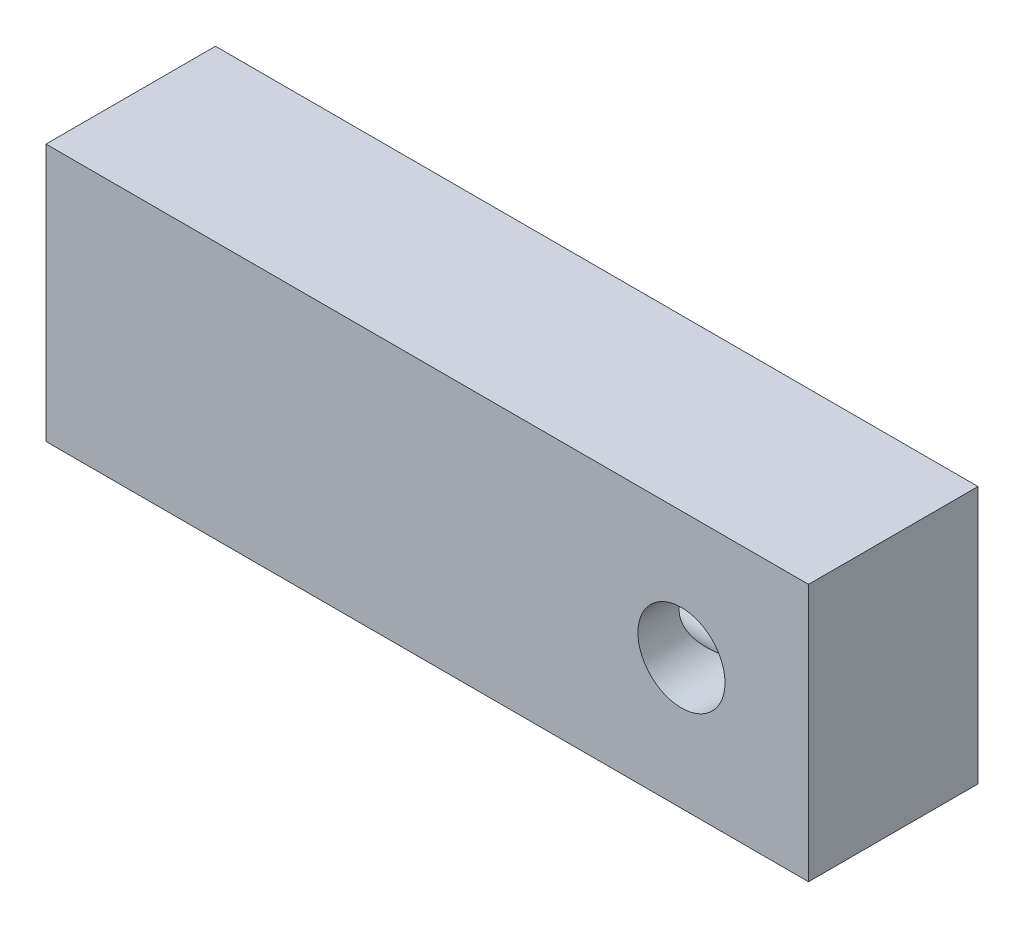
ISO-10303-21;
HEADER;
FILE_DESCRIPTION(('STEP AP214'),'2;1');
FILE_NAME('part.step','',(''),(''),'','','');
FILE_SCHEMA(('AUTOMOTIVE_DESIGN { 1 0 10303 214 1 1 1 1 }'));
ENDSEC;
DATA;
#1=APPLICATION_CONTEXT('core data for automotive mechanical design processes');
#2=APPLICATION_PROTOCOL_DEFINITION('international standard','automotive_design',2000,#1);
#3=PRODUCT_CONTEXT('',#1,'mechanical');
#4=PRODUCT('Part','Part','',(#3));
#5=PRODUCT_RELATED_PRODUCT_CATEGORY('part','',(#4));
#6=PRODUCT_DEFINITION_FORMATION('','',#4);
#7=PRODUCT_DEFINITION_CONTEXT('part definition',#1,'design');
#8=PRODUCT_DEFINITION('design','',#6,#7);
#9=PRODUCT_DEFINITION_SHAPE('','',#8);
#10=(LENGTH_UNIT() NAMED_UNIT(*) SI_UNIT(.MILLI.,.METRE.));
#11=(NAMED_UNIT(*) PLANE_ANGLE_UNIT() SI_UNIT($,.RADIAN.));
#12=(NAMED_UNIT(*) SI_UNIT($,.STERADIAN.) SOLID_ANGLE_UNIT());
#13=UNCERTAINTY_MEASURE_WITH_UNIT(LENGTH_MEASURE(1.E-05),#10,'distance_accuracy_value','');
#14=(GEOMETRIC_REPRESENTATION_CONTEXT(3) GLOBAL_UNCERTAINTY_ASSIGNED_CONTEXT((#13)) GLOBAL_UNIT_ASSIGNED_CONTEXT((#10,
#11,#12)) REPRESENTATION_CONTEXT('',''));
#15=CARTESIAN_POINT('',(0.,0.,0.));
#16=DIRECTION('',(0.,0.,1.));
#17=DIRECTION('',(1.,0.,0.));
#18=AXIS2_PLACEMENT_3D('',#15,#16,#17);
#19=CARTESIAN_POINT('',(14.2875,-4.826,6.35));
#20=DIRECTION('',(-1.,0.,0.));
#21=DIRECTION('',(0.,0.,1.));
#22=AXIS2_PLACEMENT_3D('',#19,#20,#21);
#23=PLANE('',#22);
#24=DIRECTION('',(0.,1.,0.));
#25=VECTOR('',#24,1.);
#26=CARTESIAN_POINT('',(14.2875,-4.826,0.));
#27=LINE('',#26,#25);
#28=CARTESIAN_POINT('',(14.2875,-4.826,0.));
#29=VERTEX_POINT('',#28);
#30=CARTESIAN_POINT('',(14.2875,4.826,0.));
#31=VERTEX_POINT('',#30);
#32=EDGE_CURVE('E115',#29,#31,#27,.T.);
#33=ORIENTED_EDGE('',*,*,#32,.T.);
#34=DIRECTION('',(0.,0.,-1.));
#35=VECTOR('',#34,1.);
#36=CARTESIAN_POINT('',(14.2875,4.826,6.35));
#37=LINE('',#36,#35);
#38=CARTESIAN_POINT('',(14.2875,4.826,6.35));
#39=VERTEX_POINT('',#38);
#40=EDGE_CURVE('E97',#39,#31,#37,.T.);
#41=ORIENTED_EDGE('',*,*,#40,.F.);
#42=DIRECTION('',(0.,1.,0.));
#43=VECTOR('',#42,1.);
#44=CARTESIAN_POINT('',(14.2875,-4.826,6.35));
#45=LINE('',#44,#43);
#46=CARTESIAN_POINT('',(14.2875,-4.826,6.35));
#47=VERTEX_POINT('',#46);
#48=EDGE_CURVE('E119',#47,#39,#45,.T.);
#49=ORIENTED_EDGE('',*,*,#48,.F.);
#50=DIRECTION('',(0.,0.,-1.));
#51=VECTOR('',#50,1.);
#52=CARTESIAN_POINT('',(14.2875,-4.826,6.35));
#53=LINE('',#52,#51);
#54=EDGE_CURVE('E125',#47,#29,#53,.T.);
#55=ORIENTED_EDGE('',*,*,#54,.T.);
#56=EDGE_LOOP('',(#33,#41,#49,#55));
#57=FACE_BOUND('',#56,.T.);
#58=ADVANCED_FACE('F35',(#57),#23,.F.);
#59=CARTESIAN_POINT('',(-14.2875,4.826,6.35));
#60=DIRECTION('',(0.,-1.,0.));
#61=DIRECTION('',(0.,0.,-1.));
#62=AXIS2_PLACEMENT_3D('',#59,#60,#61);
#63=PLANE('',#62);
#64=DIRECTION('',(-1.,0.,0.));
#65=VECTOR('',#64,1.);
#66=CARTESIAN_POINT('',(-14.2875,4.826,0.));
#67=LINE('',#66,#65);
#68=CARTESIAN_POINT('',(-14.2875,4.826,0.));
#69=VERTEX_POINT('',#68);
#70=EDGE_CURVE('E128',#31,#69,#67,.T.);
#71=ORIENTED_EDGE('',*,*,#70,.T.);
#72=DIRECTION('',(0.,0.,-1.));
#73=VECTOR('',#72,1.);
#74=CARTESIAN_POINT('',(-14.2875,4.826,6.35));
#75=LINE('',#74,#73);
#76=CARTESIAN_POINT('',(-14.2875,4.826,6.35));
#77=VERTEX_POINT('',#76);
#78=EDGE_CURVE('E136',#77,#69,#75,.T.);
#79=ORIENTED_EDGE('',*,*,#78,.F.);
#80=DIRECTION('',(-1.,0.,0.));
#81=VECTOR('',#80,1.);
#82=CARTESIAN_POINT('',(-14.2875,4.826,6.35));
#83=LINE('',#82,#81);
#84=EDGE_CURVE('E91',#39,#77,#83,.T.);
#85=ORIENTED_EDGE('',*,*,#84,.F.);
#86=ORIENTED_EDGE('',*,*,#40,.T.);
#87=EDGE_LOOP('',(#71,#79,#85,#86));
#88=FACE_BOUND('',#87,.T.);
#89=ADVANCED_FACE('F159',(#88),#63,.F.);
#90=CARTESIAN_POINT('',(-14.2875,-4.826,6.35));
#91=DIRECTION('',(1.,0.,0.));
#92=DIRECTION('',(0.,0.,-1.));
#93=AXIS2_PLACEMENT_3D('',#90,#91,#92);
#94=PLANE('',#93);
#95=CARTESIAN_POINT('',(-14.2875,0.,3.175));
#96=DIRECTION('',(-1.,0.,0.));
#97=DIRECTION('',(0.,0.,1.));
#98=AXIS2_PLACEMENT_3D('',#95,#96,#97);
#99=CIRCLE('',#98,1.63194999999999);
#100=CARTESIAN_POINT('',(-14.2875,0.,4.80694999999999));
#101=VERTEX_POINT('',#100);
#102=EDGE_CURVE('E101',#101,#101,#99,.T.);
#103=ORIENTED_EDGE('',*,*,#102,.F.);
#104=EDGE_LOOP('',(#103));
#105=FACE_BOUND('',#104,.T.);
#106=DIRECTION('',(0.,-1.,0.));
#107=VECTOR('',#106,1.);
#108=CARTESIAN_POINT('',(-14.2875,-4.826,0.));
#109=LINE('',#108,#107);
#110=CARTESIAN_POINT('',(-14.2875,-4.826,0.));
#111=VERTEX_POINT('',#110);
#112=EDGE_CURVE('E130',#69,#111,#109,.T.);
#113=ORIENTED_EDGE('',*,*,#112,.T.);
#114=DIRECTION('',(0.,0.,-1.));
#115=VECTOR('',#114,1.);
#116=CARTESIAN_POINT('',(-14.2875,-4.826,6.35));
#117=LINE('',#116,#115);
#118=CARTESIAN_POINT('',(-14.2875,-4.826,6.35));
#119=VERTEX_POINT('',#118);
#120=EDGE_CURVE('E134',#119,#111,#117,.T.);
#121=ORIENTED_EDGE('',*,*,#120,.F.);
#122=DIRECTION('',(0.,-1.,0.));
#123=VECTOR('',#122,1.);
#124=CARTESIAN_POINT('',(-14.2875,-4.826,6.35));
#125=LINE('',#124,#123);
#126=EDGE_CURVE('E122',#77,#119,#125,.T.);
#127=ORIENTED_EDGE('',*,*,#126,.F.);
#128=ORIENTED_EDGE('',*,*,#78,.T.);
#129=EDGE_LOOP('',(#113,#121,#127,#128));
#130=FACE_BOUND('',#129,.T.);
#131=ADVANCED_FACE('F156',(#105,#130),#94,.F.);
#132=CARTESIAN_POINT('',(-14.2875,-4.826,6.35));
#133=DIRECTION('',(0.,1.,0.));
#134=DIRECTION('',(0.,0.,1.));
#135=AXIS2_PLACEMENT_3D('',#132,#133,#134);
#136=PLANE('',#135);
#137=DIRECTION('',(1.,0.,0.));
#138=VECTOR('',#137,1.);
#139=CARTESIAN_POINT('',(-14.2875,-4.826,0.));
#140=LINE('',#139,#138);
#141=EDGE_CURVE('E83',#111,#29,#140,.T.);
#142=ORIENTED_EDGE('',*,*,#141,.T.);
#143=ORIENTED_EDGE('',*,*,#54,.F.);
#144=DIRECTION('',(1.,0.,0.));
#145=VECTOR('',#144,1.);
#146=CARTESIAN_POINT('',(-14.2875,-4.826,6.35));
#147=LINE('',#146,#145);
#148=EDGE_CURVE('E62',#119,#47,#147,.T.);
#149=ORIENTED_EDGE('',*,*,#148,.F.);
#150=ORIENTED_EDGE('',*,*,#120,.T.);
#151=EDGE_LOOP('',(#142,#143,#149,#150));
#152=FACE_BOUND('',#151,.T.);
#153=ADVANCED_FACE('F150',(#152),#136,.F.);
#154=CARTESIAN_POINT('',(0.,0.,6.35));
#155=DIRECTION('',(0.,0.,-1.));
#156=DIRECTION('',(-1.,0.,0.));
#157=AXIS2_PLACEMENT_3D('',#154,#155,#156);
#158=PLANE('',#157);
#159=CARTESIAN_POINT('',(9.525,0.0634999999999993,6.35));
#160=DIRECTION('',(0.,0.,1.));
#161=DIRECTION('',(1.,0.,0.));
#162=AXIS2_PLACEMENT_3D('',#159,#160,#161);
#163=CIRCLE('',#162,1.63194999999999);
#164=CARTESIAN_POINT('',(11.15695,0.0634999999999993,6.35));
#165=VERTEX_POINT('',#164);
#166=EDGE_CURVE('E100',#165,#165,#163,.T.);
#167=ORIENTED_EDGE('',*,*,#166,.F.);
#168=EDGE_LOOP('',(#167));
#169=FACE_BOUND('',#168,.T.);
#170=ORIENTED_EDGE('',*,*,#48,.T.);
#171=ORIENTED_EDGE('',*,*,#84,.T.);
#172=ORIENTED_EDGE('',*,*,#126,.T.);
#173=ORIENTED_EDGE('',*,*,#148,.T.);
#174=EDGE_LOOP('',(#170,#171,#172,#173));
#175=FACE_BOUND('',#174,.T.);
#176=ADVANCED_FACE('F146',(#169,#175),#158,.F.);
#177=CARTESIAN_POINT('',(0.,0.,0.));
#178=DIRECTION('',(0.,0.,-1.));
#179=DIRECTION('',(-1.,0.,0.));
#180=AXIS2_PLACEMENT_3D('',#177,#178,#179);
#181=PLANE('',#180);
#182=CARTESIAN_POINT('',(9.525,0.0634999999999993,0.));
#183=DIRECTION('',(0.,0.,1.));
#184=DIRECTION('',(1.,0.,0.));
#185=AXIS2_PLACEMENT_3D('',#182,#183,#184);
#186=CIRCLE('',#185,1.63195);
#187=CARTESIAN_POINT('',(11.15695,0.0634999999999993,0.));
#188=VERTEX_POINT('',#187);
#189=EDGE_CURVE('E110',#188,#188,#186,.T.);
#190=ORIENTED_EDGE('',*,*,#189,.T.);
#191=EDGE_LOOP('',(#190));
#192=FACE_BOUND('',#191,.T.);
#193=ORIENTED_EDGE('',*,*,#32,.F.);
#194=ORIENTED_EDGE('',*,*,#141,.F.);
#195=ORIENTED_EDGE('',*,*,#112,.F.);
#196=ORIENTED_EDGE('',*,*,#70,.F.);
#197=EDGE_LOOP('',(#193,#194,#195,#196));
#198=FACE_BOUND('',#197,.T.);
#199=ADVANCED_FACE('F106',(#192,#198),#181,.T.);
#200=CARTESIAN_POINT('',(9.525,0.0634999999999993,6.35));
#201=DIRECTION('',(0.,0.,1.));
#202=DIRECTION('',(1.,0.,0.));
#203=AXIS2_PLACEMENT_3D('',#200,#201,#202);
#204=CYLINDRICAL_SURFACE('',#203,1.63194999999999);
#205=CARTESIAN_POINT('',(9.525,-1.56844999999999,3.62580527947218));
#206=CARTESIAN_POINT('',(9.49379269750359,-1.56847118995101,3.62565450897729));
#207=CARTESIAN_POINT('',(9.46286639908088,-1.56755723285447,3.62892357274673));
#208=CARTESIAN_POINT('',(9.40270543583467,-1.56412819039295,3.64063554525705));
#209=CARTESIAN_POINT('',(9.37344926218253,-1.56164566253349,3.64897312090677));
#210=CARTESIAN_POINT('',(9.29758966178499,-1.55323870563697,3.67599855920436));
#211=CARTESIAN_POINT('',(9.25233164476064,-1.54612363371372,3.69788416238369));
#212=CARTESIAN_POINT('',(9.16463593386727,-1.52879975733794,3.74659737876402));
#213=CARTESIAN_POINT('',(9.12224404533048,-1.51855085619832,3.77348716246636));
#214=CARTESIAN_POINT('',(9.03205405051415,-1.4930516327333,3.83481555591613));
#215=CARTESIAN_POINT('',(8.98474130915257,-1.47722290764528,3.86972211528319));
#216=CARTESIAN_POINT('',(8.89248840057407,-1.44170109809979,3.94073188184941));
#217=CARTESIAN_POINT('',(8.84755059892166,-1.42200424954279,3.97683622595196));
#218=CARTESIAN_POINT('',(8.7598380762576,-1.37877917998689,4.04906812864013));
#219=CARTESIAN_POINT('',(8.71705701122725,-1.35526317321732,4.08519525902014));
#220=CARTESIAN_POINT('',(8.63346162021931,-1.30427702775738,4.15686423495839));
#221=CARTESIAN_POINT('',(8.59264634496824,-1.27680882364907,4.19240635744441));
#222=CARTESIAN_POINT('',(8.48231586530035,-1.19498711181541,4.28938065379185));
#223=CARTESIAN_POINT('',(8.41493992926262,-1.13623535887767,4.34964244296686));
#224=CARTESIAN_POINT('',(8.28826866389406,-1.0051590889832,4.46358167451706));
#225=CARTESIAN_POINT('',(8.22896250805882,-0.932853072706106,4.51726792884179));
#226=CARTESIAN_POINT('',(8.13521519532341,-0.794874175178284,4.60195160203607));
#227=CARTESIAN_POINT('',(8.09830491061473,-0.732294278041247,4.63523057803136));
#228=CARTESIAN_POINT('',(8.03215589724177,-0.599929532153175,4.69440412236936));
#229=CARTESIAN_POINT('',(8.00291275353271,-0.530148862300342,4.72030294124984));
#230=CARTESIAN_POINT('',(7.95364735339156,-0.38384741328337,4.76301070673856));
#231=CARTESIAN_POINT('',(7.93372033734387,-0.307266152676878,4.77972605970871));
#232=CARTESIAN_POINT('',(7.90518286984915,-0.150456565425692,4.80191952549368));
#233=CARTESIAN_POINT('',(7.8965587095334,-0.0702327791597148,4.80741125561113));
#234=CARTESIAN_POINT('',(7.89169036999818,0.0781982454479462,4.80650124207692));
#235=CARTESIAN_POINT('',(7.89375690865282,0.146369872053571,4.80178752830492));
#236=CARTESIAN_POINT('',(7.9061784385317,0.280834995975096,4.78403372922424));
#237=CARTESIAN_POINT('',(7.91653380217366,0.347128408764088,4.77099326979936));
#238=CARTESIAN_POINT('',(7.94430240391754,0.474335623461603,4.73784241645322));
#239=CARTESIAN_POINT('',(7.9615178362351,0.535346274580058,4.71793210506908));
#240=CARTESIAN_POINT('',(8.00192371069552,0.65287949295747,4.67199597623748));
#241=CARTESIAN_POINT('',(8.02511593921554,0.70940071177183,4.64596833061308));
#242=CARTESIAN_POINT('',(8.08817152991275,0.842208557392806,4.57567518955472));
#243=CARTESIAN_POINT('',(8.13080084957048,0.915660039589529,4.52852196695237));
#244=CARTESIAN_POINT('',(8.22343509582294,1.05142136567781,4.42601909157636));
#245=CARTESIAN_POINT('',(8.27346062964893,1.11369896785613,4.37064653643785));
#246=CARTESIAN_POINT('',(8.39735559660824,1.24786800641666,4.23255609456493));
#247=CARTESIAN_POINT('',(8.47331423771786,1.31511665923544,4.1471817845444));
#248=CARTESIAN_POINT('',(8.58964344031707,1.40167563177291,4.01249979109195));
#249=CARTESIAN_POINT('',(8.62881964847358,1.42814356091074,3.96650082421461));
#250=CARTESIAN_POINT('',(8.70718362162428,1.47649184217419,3.87216850820772));
#251=CARTESIAN_POINT('',(8.74637136456479,1.49837501545476,3.82383661726869));
#252=CARTESIAN_POINT('',(8.81622669960727,1.53392078694641,3.73377529809474));
#253=CARTESIAN_POINT('',(8.84711004453649,1.54835541266063,3.69251468056012));
#254=CARTESIAN_POINT('',(8.90687398711107,1.57420560535831,3.60756737000235));
#255=CARTESIAN_POINT('',(8.93575385421312,1.58562007530443,3.56387980236996));
#256=CARTESIAN_POINT('',(8.98184430687617,1.60255043422058,3.48523911821431));
#257=CARTESIAN_POINT('',(9.00010861261642,1.60882734548938,3.45108059269034));
#258=CARTESIAN_POINT('',(9.03220254287172,1.61935833631448,3.38043832355371));
#259=CARTESIAN_POINT('',(9.04604741621695,1.62361939645985,3.34396310758636));
#260=CARTESIAN_POINT('',(9.06316992421955,1.62875724072564,3.28031147985325));
#261=CARTESIAN_POINT('',(9.06838891428175,1.63027217032026,3.25373138895519));
#262=CARTESIAN_POINT('',(9.07427785615049,1.63197735948227,3.20005314561678));
#263=CARTESIAN_POINT('',(9.07495753233862,1.63217045079056,3.17295622541659));
#264=CARTESIAN_POINT('',(9.07164575940756,1.63121562252958,3.11912535550502));
#265=CARTESIAN_POINT('',(9.06765985523258,1.63006929483452,3.09239101304478));
#266=CARTESIAN_POINT('',(9.05580317483892,1.62655887017997,3.03985632941042));
#267=CARTESIAN_POINT('',(9.04792186723647,1.62419147124411,3.01405872484063));
#268=CARTESIAN_POINT('',(9.02097363651417,1.61577228196424,2.94069453372575));
#269=CARTESIAN_POINT('',(8.99825407247028,1.60832809074256,2.89467924312601));
#270=CARTESIAN_POINT('',(8.94809290913297,1.59031534059902,2.80591835135121));
#271=CARTESIAN_POINT('',(8.92062762260583,1.57973090808949,2.76319078560656));
#272=CARTESIAN_POINT('',(8.85759726436736,1.55320852545331,2.67148858464751));
#273=CARTESIAN_POINT('',(8.82153167474804,1.53661614503707,2.62304910965771));
#274=CARTESIAN_POINT('',(8.74826751657709,1.49934394354769,2.52862307867968));
#275=CARTESIAN_POINT('',(8.71106783091018,1.47865997437624,2.48263907265531));
#276=CARTESIAN_POINT('',(8.63664928331306,1.4331696769521,2.39281310004419));
#277=CARTESIAN_POINT('',(8.5994304445519,1.40836571540904,2.34896992227202));
#278=CARTESIAN_POINT('',(8.52571300032212,1.35453459594679,2.26338077956113));
#279=CARTESIAN_POINT('',(8.48921402051726,1.32550970244112,2.22163370617384));
#280=CARTESIAN_POINT('',(8.39286878521135,1.24162248841308,2.11239947515147));
#281=CARTESIAN_POINT('',(8.3341930407467,1.18270017023644,2.04691297636956));
#282=CARTESIAN_POINT('',(8.22348974997188,1.05176232908667,1.92396520023853));
#283=CARTESIAN_POINT('',(8.17144955026065,0.979772380408114,1.86648862859131));
#284=CARTESIAN_POINT('',(8.08914203078923,0.842151510469874,1.77534010683805));
#285=CARTESIAN_POINT('',(8.05668133890121,0.779411494751294,1.73930619060186));
#286=CARTESIAN_POINT('',(7.99918370101112,0.64689565324269,1.67493306642351));
#287=CARTESIAN_POINT('',(7.97414320254229,0.577123215782974,1.64659017690087));
#288=CARTESIAN_POINT('',(7.93316510332329,0.431087593835396,1.59912978620416));
#289=CARTESIAN_POINT('',(7.91731812714908,0.354768029845006,1.58010440791142));
#290=CARTESIAN_POINT('',(7.89676819270251,0.19873627519994,1.55327061438073));
#291=CARTESIAN_POINT('',(7.89205238056182,0.119028106019813,1.54544926524122));
#292=CARTESIAN_POINT('',(7.89423017501183,-0.0284848384044386,1.54188579352092));
#293=CARTESIAN_POINT('',(7.89949016986829,-0.0962836835961011,1.54450938590311));
#294=CARTESIAN_POINT('',(7.91822387567781,-0.22989477857369,1.55792986469255));
#295=CARTESIAN_POINT('',(7.93169808544069,-0.295706907461137,1.56872724746448));
#296=CARTESIAN_POINT('',(7.96569517000296,-0.422346607017703,1.59733747513146));
#297=CARTESIAN_POINT('',(7.98607010531792,-0.483248029676038,1.61500414458132));
#298=CARTESIAN_POINT('',(8.03289807574797,-0.600491135882633,1.65627004183732));
#299=CARTESIAN_POINT('',(8.05935301067792,-0.656831386746919,1.67987112418419));
#300=CARTESIAN_POINT('',(8.1308866810661,-0.789581417723248,1.74408908535374));
#301=CARTESIAN_POINT('',(8.17889161016552,-0.863067974310439,1.78750389013533));
#302=CARTESIAN_POINT('',(8.28310590707738,-0.998722243770917,1.88167895710908));
#303=CARTESIAN_POINT('',(8.33933846090569,-1.06085681489368,1.93245997420642));
#304=CARTESIAN_POINT('',(8.47934540772963,-1.19440058814699,2.05796047772313));
#305=CARTESIAN_POINT('',(8.56576134120034,-1.26113507494824,2.13473046222702));
#306=CARTESIAN_POINT('',(8.70206368366498,-1.34678604135186,2.25207911148241));
#307=CARTESIAN_POINT('',(8.74861163160444,-1.37292819105904,2.29156155824363));
#308=CARTESIAN_POINT('',(8.84409535183054,-1.42057523624649,2.37042723723321));
#309=CARTESIAN_POINT('',(8.89302952022819,-1.44208319529951,2.4098105178913));
#310=CARTESIAN_POINT('',(8.98411288820645,-1.47682475572066,2.47968049806104));
#311=CARTESIAN_POINT('',(9.02576402268341,-1.49085415890317,2.51042513830197));
#312=CARTESIAN_POINT('',(9.11164035772697,-1.51586766251529,2.56966656442923));
#313=CARTESIAN_POINT('',(9.15586721982211,-1.5268497702964,2.59816187078812));
#314=CARTESIAN_POINT('',(9.23284464728413,-1.5423951420731,2.64149757800236));
#315=CARTESIAN_POINT('',(9.2645974340279,-1.54788211257563,2.65775002727374));
#316=CARTESIAN_POINT('',(9.32999115176265,-1.55709000183637,2.68617273732501));
#317=CARTESIAN_POINT('',(9.36361804049374,-1.56082248217993,2.69836956291042));
#318=CARTESIAN_POINT('',(9.41872770331535,-1.56511559315191,2.71271386605295));
#319=CARTESIAN_POINT('',(9.43960592461736,-1.56634867342032,2.71693082416424));
#320=CARTESIAN_POINT('',(9.48196722194862,-1.56802372746459,2.72271059476597));
#321=CARTESIAN_POINT('',(9.50345430028836,-1.56845748095302,2.72424581999658));
#322=CARTESIAN_POINT('',(9.525,-1.56844999999999,2.72419472052781));
#323=B_SPLINE_CURVE_WITH_KNOTS('',3,(#205,#206,#207,#208,#209,#210,#211,#212,#213,#214,#215,
#216,#217,#218,#219,#220,#221,#222,#223,#224,#225,#226,#227,#228,#229,#230,#231,#232,#233,#234,
#235,#236,#237,#238,#239,#240,#241,#242,#243,#244,#245,#246,#247,#248,#249,#250,#251,#252,#253,
#254,#255,#256,#257,#258,#259,#260,#261,#262,#263,#264,#265,#266,#267,#268,#269,#270,#271,#272,
#273,#274,#275,#276,#277,#278,#279,#280,#281,#282,#283,#284,#285,#286,#287,#288,#289,#290,#291,
#292,#293,#294,#295,#296,#297,#298,#299,#300,#301,#302,#303,#304,#305,#306,#307,#308,#309,#310,
#311,#312,#313,#314,#315,#316,#317,#318,#319,#320,#321,#322),.UNSPECIFIED.,.F.,.F.,(4,2,2,2,2,2,
2,2,2,2,2,2,2,2,2,2,2,2,2,2,2,2,2,2,2,2,2,2,2,2,2,2,2,2,2,2,2,2,2,2,2,2,2,2,2,2,2,2,2,2,2,2,2,2,
2,2,2,2,4),(0.,0.0929965468362698,0.184123546281757,0.3356104690074,0.489123051095708,
0.671545994858976,0.854147343311198,1.03617580753311,1.21811547090584,1.54035527200968,
1.86215839794557,2.10102706185978,2.33975787208342,2.58087860014911,2.82170660919909,
3.02576139058117,3.22982534067969,3.42838775937585,3.62700959445124,3.91679588351003,
4.20740534187934,4.60290260179195,4.80066364618422,4.99830264179483,5.15875424486297,
5.31926405039265,5.43678339050343,5.5538927448986,5.63493092720307,5.71579544896962,
5.79656396244975,5.87755204128511,6.03223307473195,6.18770972747563,6.37533564299294,
6.56315275973997,6.75086235663561,6.93847162147963,7.25485427798484,7.57062429883159,
7.80765146910861,8.04456497703528,8.28377581482499,8.52271028510444,8.72584431489713,
8.92899068127304,9.12803192770229,9.32713545322702,9.61927232011901,9.91224889793941,
10.3103737359663,10.5094422210137,10.7083786992407,10.8691712944,11.03006878654,
11.1381561276666,11.2455208577993,11.3093512229725,11.3738344338019),.UNSPECIFIED.);
#324=CARTESIAN_POINT('',(9.525,-1.56844999999999,3.62580527947218));
#325=VERTEX_POINT('',#324);
#326=CARTESIAN_POINT('',(9.525,-1.56844999999999,2.72419472052782));
#327=VERTEX_POINT('',#326);
#328=EDGE_CURVE('E47',#325,#327,#323,.T.);
#329=ORIENTED_EDGE('',*,*,#328,.T.);
#330=CARTESIAN_POINT('',(9.42674255127779,-1.56548934197575,2.29580499820865));
#331=CARTESIAN_POINT('',(9.44937324560624,-1.56686079662221,2.37518198727211));
#332=CARTESIAN_POINT('',(9.47007910543582,-1.56762645505907,2.4552153119264));
#333=CARTESIAN_POINT('',(9.50624993124118,-1.56844200668185,2.61669300046983));
#334=CARTESIAN_POINT('',(9.52169936358872,-1.56848979609556,2.69814081163488));
#335=CARTESIAN_POINT('',(9.54550737252654,-1.5683648263693,2.85997786041787));
#336=CARTESIAN_POINT('',(9.55403756612511,-1.56819768943298,2.94034071307162));
#337=CARTESIAN_POINT('',(9.56361269416557,-1.56800114645337,3.10140887793712));
#338=CARTESIAN_POINT('',(9.564668943183,-1.56797153224202,3.18211348734414));
#339=CARTESIAN_POINT('',(9.55968194635436,-1.56808179974103,3.32902143270997));
#340=CARTESIAN_POINT('',(9.55485879237025,-1.56819268949431,3.39527024727031));
#341=CARTESIAN_POINT('',(9.54050052758204,-1.56839210977136,3.52725956998319));
#342=CARTESIAN_POINT('',(9.5309644533038,-1.56848063571766,3.59299997140737));
#343=CARTESIAN_POINT('',(9.50761888866357,-1.56839939177584,3.72520548505887));
#344=CARTESIAN_POINT('',(9.49371907446082,-1.56822383361706,3.79165419862217));
#345=CARTESIAN_POINT('',(9.46255412333828,-1.56733014809897,3.92360491318207));
#346=CARTESIAN_POINT('',(9.4452965109035,-1.56661322372466,3.98910868553431));
#347=CARTESIAN_POINT('',(9.42674255127782,-1.56548934197576,4.05419500179135));
#348=B_SPLINE_CURVE_WITH_KNOTS('',3,(#330,#331,#332,#333,#334,#335,#336,#337,#338,#339,#340,
#341,#342,#343,#344,#345,#346,#347),.UNSPECIFIED.,.F.,.F.,(4,2,2,2,2,2,2,2,4),(0.,
0.247771641352482,0.496269255993335,0.738396809241101,0.980157734434925,1.17925017264228,
1.37838332866318,1.58194519454972,1.78505604618767),.UNSPECIFIED.);
#349=EDGE_CURVE('E11',#327,#325,#348,.T.);
#350=ORIENTED_EDGE('',*,*,#349,.T.);
#351=EDGE_LOOP('',(#329,#350));
#352=FACE_BOUND('',#351,.T.);
#353=ORIENTED_EDGE('',*,*,#189,.F.);
#354=EDGE_LOOP('',(#353));
#355=FACE_BOUND('',#354,.T.);
#356=ORIENTED_EDGE('',*,*,#166,.T.);
#357=EDGE_LOOP('',(#356));
#358=FACE_BOUND('',#357,.T.);
#359=ADVANCED_FACE('F103',(#352,#355,#358),#204,.F.);
#360=CARTESIAN_POINT('',(9.525,0.,3.175));
#361=DIRECTION('',(-1.,0.,0.));
#362=DIRECTION('',(0.,0.,1.));
#363=AXIS2_PLACEMENT_3D('',#360,#361,#362);
#364=CONICAL_SURFACE('',#363,1.63194999999999,1.02974425867665);
#365=CARTESIAN_POINT('',(9.525,0.,3.175));
#366=DIRECTION('',(-1.,0.,0.));
#367=DIRECTION('',(0.,0.,1.));
#368=AXIS2_PLACEMENT_3D('',#365,#366,#367);
#369=CIRCLE('',#368,1.63194999999999);
#370=EDGE_CURVE('E53',#327,#325,#369,.T.);
#371=ORIENTED_EDGE('',*,*,#370,.T.);
#372=ORIENTED_EDGE('',*,*,#349,.F.);
#373=EDGE_LOOP('',(#371,#372));
#374=FACE_BOUND('',#373,.T.);
#375=ADVANCED_FACE('F99',(#374),#364,.F.);
#376=CARTESIAN_POINT('',(-14.2875,0.,3.175));
#377=DIRECTION('',(-1.,0.,0.));
#378=DIRECTION('',(0.,0.,1.));
#379=AXIS2_PLACEMENT_3D('',#376,#377,#378);
#380=CYLINDRICAL_SURFACE('',#379,1.63194999999999);
#381=ORIENTED_EDGE('',*,*,#370,.F.);
#382=ORIENTED_EDGE('',*,*,#328,.F.);
#383=EDGE_LOOP('',(#381,#382));
#384=FACE_BOUND('',#383,.T.);
#385=ORIENTED_EDGE('',*,*,#102,.T.);
#386=EDGE_LOOP('',(#385));
#387=FACE_BOUND('',#386,.T.);
#388=ADVANCED_FACE('F94',(#384,#387),#380,.F.);
#389=CLOSED_SHELL('',(#58,#89,#131,#153,#176,#199,#359,#375,#388));
#390=MANIFOLD_SOLID_BREP('B2',#389);
#391=ADVANCED_BREP_SHAPE_REPRESENTATION('',(#18,#390),#14);
#392=SHAPE_DEFINITION_REPRESENTATION(#9,#391);
ENDSEC;
END-ISO-10303-21;
